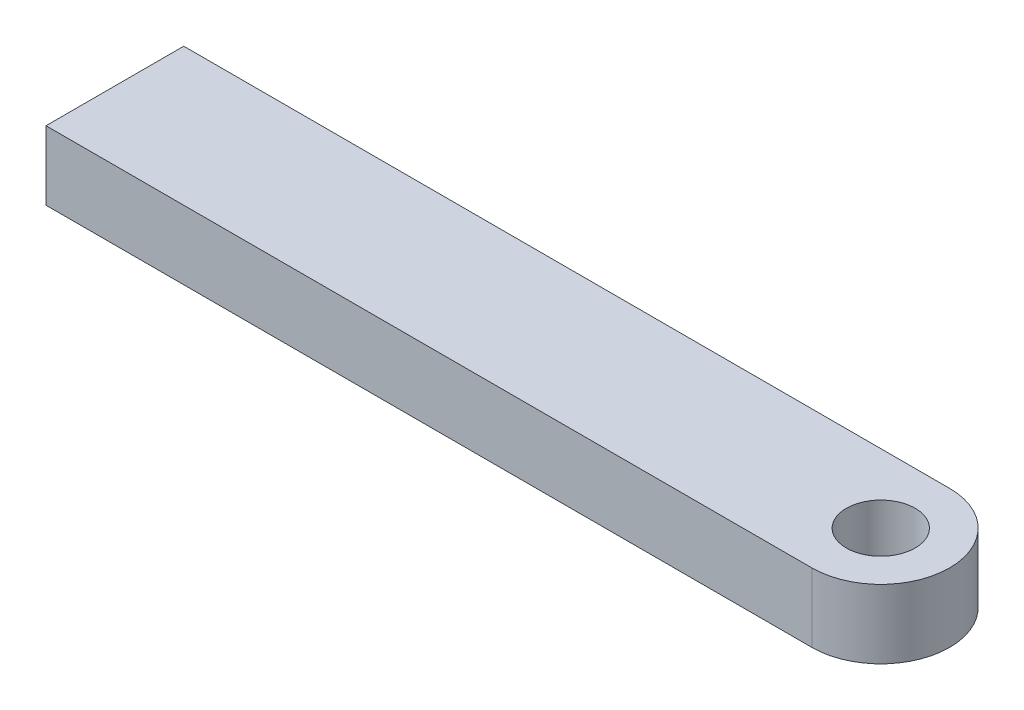
ISO-10303-21;
HEADER;
FILE_DESCRIPTION(('STEP AP214'),'2;1');
FILE_NAME('part.step','',(''),(''),'','','');
FILE_SCHEMA(('AUTOMOTIVE_DESIGN { 1 0 10303 214 1 1 1 1 }'));
ENDSEC;
DATA;
#1=APPLICATION_CONTEXT('core data for automotive mechanical design processes');
#2=APPLICATION_PROTOCOL_DEFINITION('international standard','automotive_design',2000,#1);
#3=PRODUCT_CONTEXT('',#1,'mechanical');
#4=PRODUCT('Part','Part','',(#3));
#5=PRODUCT_RELATED_PRODUCT_CATEGORY('part','',(#4));
#6=PRODUCT_DEFINITION_FORMATION('','',#4);
#7=PRODUCT_DEFINITION_CONTEXT('part definition',#1,'design');
#8=PRODUCT_DEFINITION('design','',#6,#7);
#9=PRODUCT_DEFINITION_SHAPE('','',#8);
#10=(LENGTH_UNIT() NAMED_UNIT(*) SI_UNIT(.MILLI.,.METRE.));
#11=(NAMED_UNIT(*) PLANE_ANGLE_UNIT() SI_UNIT($,.RADIAN.));
#12=(NAMED_UNIT(*) SI_UNIT($,.STERADIAN.) SOLID_ANGLE_UNIT());
#13=UNCERTAINTY_MEASURE_WITH_UNIT(LENGTH_MEASURE(1.E-05),#10,'distance_accuracy_value','');
#14=(GEOMETRIC_REPRESENTATION_CONTEXT(3) GLOBAL_UNCERTAINTY_ASSIGNED_CONTEXT((#13)) GLOBAL_UNIT_ASSIGNED_CONTEXT((#10,
#11,#12)) REPRESENTATION_CONTEXT('',''));
#15=CARTESIAN_POINT('',(0.,0.,0.));
#16=DIRECTION('',(0.,0.,1.));
#17=DIRECTION('',(1.,0.,0.));
#18=AXIS2_PLACEMENT_3D('',#15,#16,#17);
#19=CARTESIAN_POINT('',(0.,2.5,0.));
#20=DIRECTION('',(0.,1.,0.));
#21=DIRECTION('',(0.,0.,1.));
#22=AXIS2_PLACEMENT_3D('',#19,#20,#21);
#23=PLANE('',#22);
#24=DIRECTION('',(0.,0.,1.));
#25=VECTOR('',#24,1.);
#26=CARTESIAN_POINT('',(-55.6,2.5,-4.99999999999999));
#27=LINE('',#26,#25);
#28=CARTESIAN_POINT('',(-55.6,2.5,-4.99999999999999));
#29=VERTEX_POINT('',#28);
#30=CARTESIAN_POINT('',(-55.6,2.5,5.));
#31=VERTEX_POINT('',#30);
#32=EDGE_CURVE('E124',#29,#31,#27,.T.);
#33=ORIENTED_EDGE('',*,*,#32,.T.);
#34=DIRECTION('',(1.,0.,0.));
#35=VECTOR('',#34,1.);
#36=CARTESIAN_POINT('',(-55.6,2.5,5.));
#37=LINE('',#36,#35);
#38=CARTESIAN_POINT('',(0.,2.5,5.));
#39=VERTEX_POINT('',#38);
#40=EDGE_CURVE('E96',#31,#39,#37,.T.);
#41=ORIENTED_EDGE('',*,*,#40,.T.);
#42=CARTESIAN_POINT('',(0.,2.5,0.));
#43=DIRECTION('',(0.,1.,0.));
#44=DIRECTION('',(0.,0.,1.));
#45=AXIS2_PLACEMENT_3D('',#42,#43,#44);
#46=CIRCLE('',#45,5.);
#47=CARTESIAN_POINT('',(0.,2.5,-5.));
#48=VERTEX_POINT('',#47);
#49=EDGE_CURVE('E127',#39,#48,#46,.T.);
#50=ORIENTED_EDGE('',*,*,#49,.T.);
#51=DIRECTION('',(-1.,0.,0.));
#52=VECTOR('',#51,1.);
#53=CARTESIAN_POINT('',(0.,2.5,-5.));
#54=LINE('',#53,#52);
#55=EDGE_CURVE('E65',#48,#29,#54,.T.);
#56=ORIENTED_EDGE('',*,*,#55,.T.);
#57=EDGE_LOOP('',(#33,#41,#50,#56));
#58=FACE_BOUND('',#57,.T.);
#59=CARTESIAN_POINT('',(0.,2.5,0.));
#60=DIRECTION('',(0.,1.,0.));
#61=DIRECTION('',(0.,0.,1.));
#62=AXIS2_PLACEMENT_3D('',#59,#60,#61);
#63=CIRCLE('',#62,2.5);
#64=CARTESIAN_POINT('',(0.,2.5,2.5));
#65=VERTEX_POINT('',#64);
#66=EDGE_CURVE('E114',#65,#65,#63,.T.);
#67=ORIENTED_EDGE('',*,*,#66,.F.);
#68=EDGE_LOOP('',(#67));
#69=FACE_BOUND('',#68,.T.);
#70=ADVANCED_FACE('F48',(#58,#69),#23,.T.);
#71=CARTESIAN_POINT('',(0.,-2.5,0.));
#72=DIRECTION('',(0.,1.,0.));
#73=DIRECTION('',(0.,0.,1.));
#74=AXIS2_PLACEMENT_3D('',#71,#72,#73);
#75=PLANE('',#74);
#76=DIRECTION('',(0.,0.,1.));
#77=VECTOR('',#76,1.);
#78=CARTESIAN_POINT('',(-55.6,-2.5,-4.99999999999999));
#79=LINE('',#78,#77);
#80=CARTESIAN_POINT('',(-55.6,-2.5,-4.99999999999999));
#81=VERTEX_POINT('',#80);
#82=CARTESIAN_POINT('',(-55.6,-2.5,5.));
#83=VERTEX_POINT('',#82);
#84=EDGE_CURVE('E122',#81,#83,#79,.T.);
#85=ORIENTED_EDGE('',*,*,#84,.F.);
#86=DIRECTION('',(-1.,0.,0.));
#87=VECTOR('',#86,1.);
#88=CARTESIAN_POINT('',(0.,-2.5,-5.));
#89=LINE('',#88,#87);
#90=CARTESIAN_POINT('',(0.,-2.5,-5.));
#91=VERTEX_POINT('',#90);
#92=EDGE_CURVE('E89',#91,#81,#89,.T.);
#93=ORIENTED_EDGE('',*,*,#92,.F.);
#94=CARTESIAN_POINT('',(0.,-2.5,0.));
#95=DIRECTION('',(0.,1.,0.));
#96=DIRECTION('',(0.,0.,1.));
#97=AXIS2_PLACEMENT_3D('',#94,#95,#96);
#98=CIRCLE('',#97,5.);
#99=CARTESIAN_POINT('',(0.,-2.5,5.));
#100=VERTEX_POINT('',#99);
#101=EDGE_CURVE('E83',#100,#91,#98,.T.);
#102=ORIENTED_EDGE('',*,*,#101,.F.);
#103=DIRECTION('',(1.,0.,0.));
#104=VECTOR('',#103,1.);
#105=CARTESIAN_POINT('',(-55.6,-2.5,5.));
#106=LINE('',#105,#104);
#107=EDGE_CURVE('E133',#83,#100,#106,.T.);
#108=ORIENTED_EDGE('',*,*,#107,.F.);
#109=EDGE_LOOP('',(#85,#93,#102,#108));
#110=FACE_BOUND('',#109,.T.);
#111=CARTESIAN_POINT('',(0.,-2.5,0.));
#112=DIRECTION('',(0.,1.,0.));
#113=DIRECTION('',(0.,0.,1.));
#114=AXIS2_PLACEMENT_3D('',#111,#112,#113);
#115=CIRCLE('',#114,2.5);
#116=CARTESIAN_POINT('',(0.,-2.5,2.5));
#117=VERTEX_POINT('',#116);
#118=EDGE_CURVE('E110',#117,#117,#115,.T.);
#119=ORIENTED_EDGE('',*,*,#118,.T.);
#120=EDGE_LOOP('',(#119));
#121=FACE_BOUND('',#120,.T.);
#122=ADVANCED_FACE('F143',(#110,#121),#75,.F.);
#123=CARTESIAN_POINT('',(-55.6,2.5,-4.99999999999999));
#124=DIRECTION('',(1.,0.,0.));
#125=DIRECTION('',(0.,0.,-1.));
#126=AXIS2_PLACEMENT_3D('',#123,#124,#125);
#127=PLANE('',#126);
#128=CARTESIAN_POINT('',(-55.6,-0.25,2.31481500634345E-13));
#129=DIRECTION('',(-1.,0.,0.));
#130=DIRECTION('',(0.,0.,1.));
#131=AXIS2_PLACEMENT_3D('',#128,#129,#130);
#132=CIRCLE('',#131,1.525);
#133=CARTESIAN_POINT('',(-55.6,-0.25,1.52500000000023));
#134=VERTEX_POINT('',#133);
#135=EDGE_CURVE('E117',#134,#134,#132,.T.);
#136=ORIENTED_EDGE('',*,*,#135,.F.);
#137=EDGE_LOOP('',(#136));
#138=FACE_BOUND('',#137,.T.);
#139=ORIENTED_EDGE('',*,*,#84,.T.);
#140=DIRECTION('',(0.,-1.,0.));
#141=VECTOR('',#140,1.);
#142=CARTESIAN_POINT('',(-55.6,2.5,5.));
#143=LINE('',#142,#141);
#144=EDGE_CURVE('E13',#31,#83,#143,.T.);
#145=ORIENTED_EDGE('',*,*,#144,.F.);
#146=ORIENTED_EDGE('',*,*,#32,.F.);
#147=DIRECTION('',(0.,-1.,0.));
#148=VECTOR('',#147,1.);
#149=CARTESIAN_POINT('',(-55.6,2.5,-4.99999999999999));
#150=LINE('',#149,#148);
#151=EDGE_CURVE('E130',#29,#81,#150,.T.);
#152=ORIENTED_EDGE('',*,*,#151,.T.);
#153=EDGE_LOOP('',(#139,#145,#146,#152));
#154=FACE_BOUND('',#153,.T.);
#155=ADVANCED_FACE('F50',(#138,#154),#127,.F.);
#156=CARTESIAN_POINT('',(-55.6,2.5,5.));
#157=DIRECTION('',(0.,0.,-1.));
#158=DIRECTION('',(-1.,0.,0.));
#159=AXIS2_PLACEMENT_3D('',#156,#157,#158);
#160=PLANE('',#159);
#161=ORIENTED_EDGE('',*,*,#107,.T.);
#162=DIRECTION('',(0.,-1.,0.));
#163=VECTOR('',#162,1.);
#164=CARTESIAN_POINT('',(0.,2.5,5.));
#165=LINE('',#164,#163);
#166=EDGE_CURVE('E57',#39,#100,#165,.T.);
#167=ORIENTED_EDGE('',*,*,#166,.F.);
#168=ORIENTED_EDGE('',*,*,#40,.F.);
#169=ORIENTED_EDGE('',*,*,#144,.T.);
#170=EDGE_LOOP('',(#161,#167,#168,#169));
#171=FACE_BOUND('',#170,.T.);
#172=ADVANCED_FACE('F157',(#171),#160,.F.);
#173=CARTESIAN_POINT('',(0.,2.5,0.));
#174=DIRECTION('',(0.,-1.,0.));
#175=DIRECTION('',(0.,0.,-1.));
#176=AXIS2_PLACEMENT_3D('',#173,#174,#175);
#177=CYLINDRICAL_SURFACE('',#176,5.);
#178=ORIENTED_EDGE('',*,*,#101,.T.);
#179=DIRECTION('',(0.,-1.,0.));
#180=VECTOR('',#179,1.);
#181=CARTESIAN_POINT('',(0.,2.5,-5.));
#182=LINE('',#181,#180);
#183=EDGE_CURVE('E138',#48,#91,#182,.T.);
#184=ORIENTED_EDGE('',*,*,#183,.F.);
#185=ORIENTED_EDGE('',*,*,#49,.F.);
#186=ORIENTED_EDGE('',*,*,#166,.T.);
#187=EDGE_LOOP('',(#178,#184,#185,#186));
#188=FACE_BOUND('',#187,.T.);
#189=ADVANCED_FACE('F140',(#188),#177,.T.);
#190=CARTESIAN_POINT('',(0.,2.5,-5.));
#191=DIRECTION('',(0.,0.,1.));
#192=DIRECTION('',(1.,0.,0.));
#193=AXIS2_PLACEMENT_3D('',#190,#191,#192);
#194=PLANE('',#193);
#195=ORIENTED_EDGE('',*,*,#92,.T.);
#196=ORIENTED_EDGE('',*,*,#151,.F.);
#197=ORIENTED_EDGE('',*,*,#55,.F.);
#198=ORIENTED_EDGE('',*,*,#183,.T.);
#199=EDGE_LOOP('',(#195,#196,#197,#198));
#200=FACE_BOUND('',#199,.T.);
#201=ADVANCED_FACE('F148',(#200),#194,.F.);
#202=CARTESIAN_POINT('',(0.,2.5,0.));
#203=DIRECTION('',(0.,-1.,0.));
#204=DIRECTION('',(0.,0.,-1.));
#205=AXIS2_PLACEMENT_3D('',#202,#203,#204);
#206=CYLINDRICAL_SURFACE('',#205,2.5);
#207=ORIENTED_EDGE('',*,*,#66,.T.);
#208=EDGE_LOOP('',(#207));
#209=FACE_BOUND('',#208,.T.);
#210=ORIENTED_EDGE('',*,*,#118,.F.);
#211=EDGE_LOOP('',(#210));
#212=FACE_BOUND('',#211,.T.);
#213=ADVANCED_FACE('F104',(#209,#212),#206,.F.);
#214=CARTESIAN_POINT('',(-43.1,-0.25,1.79439796355041E-13));
#215=DIRECTION('',(-1.,0.,0.));
#216=DIRECTION('',(0.,0.,1.));
#217=AXIS2_PLACEMENT_3D('',#214,#215,#216);
#218=CONICAL_SURFACE('',#217,1.24999999999999,1.02974425867665);
#219=CARTESIAN_POINT('',(-42.3489242262156,-0.250000000000003,1.7631281529019E-13));
#220=VERTEX_POINT('',#219);
#221=VERTEX_LOOP('',#220);
#222=FACE_BOUND('',#221,.T.);
#223=CARTESIAN_POINT('',(-43.1,-0.25,1.79439796355041E-13));
#224=DIRECTION('',(-1.,0.,0.));
#225=DIRECTION('',(0.,0.,1.));
#226=AXIS2_PLACEMENT_3D('',#223,#224,#225);
#227=CIRCLE('',#226,1.24999999999999);
#228=CARTESIAN_POINT('',(-43.1,-0.25,1.25000000000017));
#229=VERTEX_POINT('',#228);
#230=EDGE_CURVE('E108',#229,#229,#227,.T.);
#231=ORIENTED_EDGE('',*,*,#230,.T.);
#232=EDGE_LOOP('',(#231));
#233=FACE_BOUND('',#232,.T.);
#234=ADVANCED_FACE('F100',(#222,#233),#218,.F.);
#235=CARTESIAN_POINT('',(-55.6,-0.25,2.31481500634345E-13));
#236=DIRECTION('',(-1.,0.,0.));
#237=DIRECTION('',(0.,0.,1.));
#238=AXIS2_PLACEMENT_3D('',#235,#236,#237);
#239=CYLINDRICAL_SURFACE('',#238,1.24999999999999);
#240=ORIENTED_EDGE('',*,*,#230,.F.);
#241=EDGE_LOOP('',(#240));
#242=FACE_BOUND('',#241,.T.);
#243=CARTESIAN_POINT('',(-55.325,-0.25,2.30336583140201E-13));
#244=DIRECTION('',(-1.,0.,0.));
#245=DIRECTION('',(0.,0.,1.));
#246=AXIS2_PLACEMENT_3D('',#243,#244,#245);
#247=CIRCLE('',#246,1.25);
#248=CARTESIAN_POINT('',(-55.325,-0.25,1.25000000000023));
#249=VERTEX_POINT('',#248);
#250=EDGE_CURVE('E111',#249,#249,#247,.T.);
#251=ORIENTED_EDGE('',*,*,#250,.T.);
#252=EDGE_LOOP('',(#251));
#253=FACE_BOUND('',#252,.T.);
#254=ADVANCED_FACE('F103',(#242,#253),#239,.F.);
#255=CARTESIAN_POINT('',(-55.6,-0.25,2.31481500634345E-13));
#256=DIRECTION('',(-1.,0.,0.));
#257=DIRECTION('',(0.,0.,1.));
#258=AXIS2_PLACEMENT_3D('',#255,#256,#257);
#259=CONICAL_SURFACE('',#258,1.525,0.785398163397456);
#260=ORIENTED_EDGE('',*,*,#250,.F.);
#261=EDGE_LOOP('',(#260));
#262=FACE_BOUND('',#261,.T.);
#263=ORIENTED_EDGE('',*,*,#135,.T.);
#264=EDGE_LOOP('',(#263));
#265=FACE_BOUND('',#264,.T.);
#266=ADVANCED_FACE('F169',(#262,#265),#259,.F.);
#267=CLOSED_SHELL('',(#70,#122,#155,#172,#189,#201,#213,#234,#254,#266));
#268=MANIFOLD_SOLID_BREP('B2',#267);
#269=ADVANCED_BREP_SHAPE_REPRESENTATION('',(#18,#268),#14);
#270=SHAPE_DEFINITION_REPRESENTATION(#9,#269);
ENDSEC;
END-ISO-10303-21;
